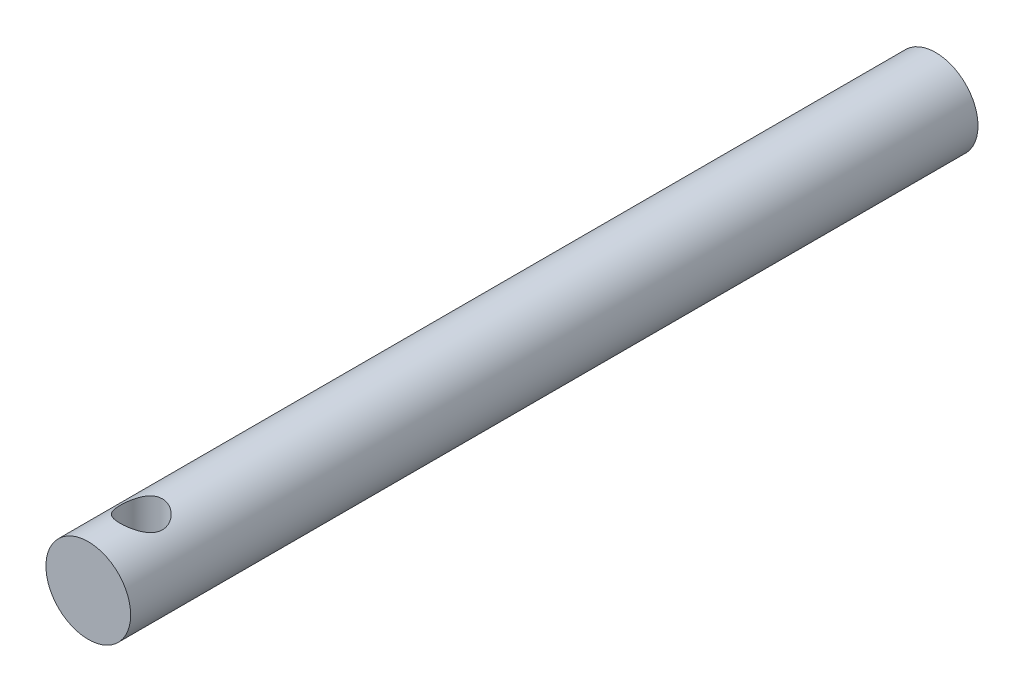
ISO-10303-21;
HEADER;
FILE_DESCRIPTION(('STEP AP214'),'2;1');
FILE_NAME('part.step','',(''),(''),'','','');
FILE_SCHEMA(('AUTOMOTIVE_DESIGN { 1 0 10303 214 1 1 1 1 }'));
ENDSEC;
DATA;
#1=APPLICATION_CONTEXT('core data for automotive mechanical design processes');
#2=APPLICATION_PROTOCOL_DEFINITION('international standard','automotive_design',2000,#1);
#3=PRODUCT_CONTEXT('',#1,'mechanical');
#4=PRODUCT('Part','Part','',(#3));
#5=PRODUCT_RELATED_PRODUCT_CATEGORY('part','',(#4));
#6=PRODUCT_DEFINITION_FORMATION('','',#4);
#7=PRODUCT_DEFINITION_CONTEXT('part definition',#1,'design');
#8=PRODUCT_DEFINITION('design','',#6,#7);
#9=PRODUCT_DEFINITION_SHAPE('','',#8);
#10=(LENGTH_UNIT() NAMED_UNIT(*) SI_UNIT(.MILLI.,.METRE.));
#11=(NAMED_UNIT(*) PLANE_ANGLE_UNIT() SI_UNIT($,.RADIAN.));
#12=(NAMED_UNIT(*) SI_UNIT($,.STERADIAN.) SOLID_ANGLE_UNIT());
#13=UNCERTAINTY_MEASURE_WITH_UNIT(LENGTH_MEASURE(1.E-05),#10,'distance_accuracy_value','');
#14=(GEOMETRIC_REPRESENTATION_CONTEXT(3) GLOBAL_UNCERTAINTY_ASSIGNED_CONTEXT((#13)) GLOBAL_UNIT_ASSIGNED_CONTEXT((#10,
#11,#12)) REPRESENTATION_CONTEXT('',''));
#15=CARTESIAN_POINT('',(0.,0.,0.));
#16=DIRECTION('',(0.,0.,1.));
#17=DIRECTION('',(1.,0.,0.));
#18=AXIS2_PLACEMENT_3D('',#15,#16,#17);
#19=CARTESIAN_POINT('',(0.,0.,160.));
#20=DIRECTION('',(0.,0.,-1.));
#21=DIRECTION('',(-1.,0.,0.));
#22=AXIS2_PLACEMENT_3D('',#19,#20,#21);
#23=CYLINDRICAL_SURFACE('',#22,8.);
#24=CARTESIAN_POINT('',(0.,-8.,146.));
#25=CARTESIAN_POINT('',(0.105191216468488,-7.99999964432188,146.000000404848));
#26=CARTESIAN_POINT('',(0.210389995368427,-7.99792027620652,146.004154457315));
#27=CARTESIAN_POINT('',(0.420011249701337,-7.98965597150982,146.020722078099));
#28=CARTESIAN_POINT('',(0.524433367425621,-7.98346924887743,146.03313923957));
#29=CARTESIAN_POINT('',(0.731828138370608,-7.96713597659603,146.066113514695));
#30=CARTESIAN_POINT('',(0.834798506711921,-7.95698378017499,146.086682236657));
#31=CARTESIAN_POINT('',(1.0384152051955,-7.93298382243633,146.135717207556));
#32=CARTESIAN_POINT('',(1.13906056699381,-7.91913455043164,146.164186685064));
#33=CARTESIAN_POINT('',(1.43561775388138,-7.87265974292142,146.260748231118));
#34=CARTESIAN_POINT('',(1.62719620658471,-7.83501976471674,146.340162980847));
#35=CARTESIAN_POINT('',(1.99392146995423,-7.74982886318844,146.526289041088));
#36=CARTESIAN_POINT('',(2.16906957469775,-7.70227872135526,146.632998199381));
#37=CARTESIAN_POINT('',(2.51002321260363,-7.59825056785885,146.878069822599));
#38=CARTESIAN_POINT('',(2.67462250306453,-7.54140647262265,147.017956688194));
#39=CARTESIAN_POINT('',(2.97911611963432,-7.42640030348014,147.322075137586));
#40=CARTESIAN_POINT('',(3.11899161990725,-7.36823726296469,147.486325099043));
#41=CARTESIAN_POINT('',(3.38102385527716,-7.25195135134797,147.84997898713));
#42=CARTESIAN_POINT('',(3.50096528772936,-7.19418138823907,148.051121304275));
#43=CARTESIAN_POINT('',(3.65378721735264,-7.11709930290977,148.367934539954));
#44=CARTESIAN_POINT('',(3.70022392693972,-7.09299422837207,148.476094662807));
#45=CARTESIAN_POINT('',(3.78359067078058,-7.04887690211805,148.696800971079));
#46=CARTESIAN_POINT('',(3.82052633371566,-7.02886222858683,148.809344513922));
#47=CARTESIAN_POINT('',(3.88251046204455,-6.9948044998643,149.031194219306));
#48=CARTESIAN_POINT('',(3.9081340887804,-6.9804776446802,149.140296419165));
#49=CARTESIAN_POINT('',(3.95018060072942,-6.95677065788592,149.36074052282));
#50=CARTESIAN_POINT('',(3.96660836750271,-6.9473879018896,149.472081205753));
#51=CARTESIAN_POINT('',(3.99001913809429,-6.93396933490057,149.696006093466));
#52=CARTESIAN_POINT('',(3.99700782997253,-6.92993030376772,149.808589508088));
#53=CARTESIAN_POINT('',(4.00144340059851,-6.92737022415464,150.034000478039));
#54=CARTESIAN_POINT('',(3.99889118971828,-6.92884864921081,150.146828009047));
#55=CARTESIAN_POINT('',(3.98516575152016,-6.93675038555111,150.358164378446));
#56=CARTESIAN_POINT('',(3.97506329407581,-6.94255931040712,150.456767439572));
#57=CARTESIAN_POINT('',(3.94763759493625,-6.95818925294571,150.652651612166));
#58=CARTESIAN_POINT('',(3.9303120853467,-6.96801153072176,150.74993229852));
#59=CARTESIAN_POINT('',(3.86777248849785,-7.00304835203764,151.0387791329));
#60=CARTESIAN_POINT('',(3.8119855502641,-7.03383903740602,151.227495457081));
#61=CARTESIAN_POINT('',(3.6728359957252,-7.10749917506982,151.596946332771));
#62=CARTESIAN_POINT('',(3.58886132884633,-7.15063327143764,151.777392575348));
#63=CARTESIAN_POINT('',(3.39616568981264,-7.2441365265382,152.122530187015));
#64=CARTESIAN_POINT('',(3.28743360222608,-7.29450893132236,152.287214432065));
#65=CARTESIAN_POINT('',(3.03227252755196,-7.40452458073482,152.618082881705));
#66=CARTESIAN_POINT('',(2.88281182497071,-7.46453347888883,152.781809570708));
#67=CARTESIAN_POINT('',(2.55818830727484,-7.58191186589975,153.0829596065));
#68=CARTESIAN_POINT('',(2.38301327894515,-7.63928008344307,153.220370382475));
#69=CARTESIAN_POINT('',(2.09944472683199,-7.72027607686169,153.406753030214));
#70=CARTESIAN_POINT('',(1.9989679987013,-7.74696304862188,153.466681759753));
#71=CARTESIAN_POINT('',(1.79256850112002,-7.79730441532266,153.577766478777));
#72=CARTESIAN_POINT('',(1.68664805204876,-7.82096008757468,153.628926166398));
#73=CARTESIAN_POINT('',(1.47010242051538,-7.86454042959534,153.721919122373));
#74=CARTESIAN_POINT('',(1.35947915341347,-7.88446660078232,153.763756145133));
#75=CARTESIAN_POINT('',(1.13432950721216,-7.91999221203723,153.837619938552));
#76=CARTESIAN_POINT('',(1.01980357880327,-7.9355921498224,153.869647837759));
#77=CARTESIAN_POINT('',(0.797438403015323,-7.96087677585623,153.921226847855));
#78=CARTESIAN_POINT('',(0.689830906854559,-7.9709443603734,153.941591597057));
#79=CARTESIAN_POINT('',(0.472998720376374,-7.98674429615844,153.973446448242));
#80=CARTESIAN_POINT('',(0.363774173887717,-7.99247703065614,153.984937334737));
#81=CARTESIAN_POINT('',(0.144648447401167,-7.99944300548302,153.998890471544));
#82=CARTESIAN_POINT('',(0.0347475425961409,-8.00067796839692,154.001356178379));
#83=CARTESIAN_POINT('',(-0.184837638972489,-7.99861804620746,153.99723575789));
#84=CARTESIAN_POINT('',(-0.294521925108022,-7.99532336157662,153.990650031163));
#85=CARTESIAN_POINT('',(-0.504259611746538,-7.98472734940324,153.969376430473));
#86=CARTESIAN_POINT('',(-0.604398259266984,-7.97775776257091,153.955358930896));
#87=CARTESIAN_POINT('',(-0.803035609307671,-7.96021983565122,153.919863600336));
#88=CARTESIAN_POINT('',(-0.901533743070591,-7.94965027363514,153.898383236207));
#89=CARTESIAN_POINT('',(-1.19351737727533,-7.91289127905722,153.8230648264));
#90=CARTESIAN_POINT('',(-1.38368108667205,-7.88164133135127,153.758329859409));
#91=CARTESIAN_POINT('',(-1.75558493783057,-7.80736894774679,153.600001891094));
#92=CARTESIAN_POINT('',(-1.93692876519228,-7.76403545540106,153.505636690828));
#93=CARTESIAN_POINT('',(-2.28183826656571,-7.66975878800211,153.29156896574));
#94=CARTESIAN_POINT('',(-2.44539632212196,-7.61881237399843,153.171855647368));
#95=CARTESIAN_POINT('',(-2.76706877708067,-7.50833088367007,152.896966880297));
#96=CARTESIAN_POINT('',(-2.92307134240143,-7.44844369061623,152.739463462741));
#97=CARTESIAN_POINT('',(-3.20744226426285,-7.33048735856256,152.400264434745));
#98=CARTESIAN_POINT('',(-3.33579150415336,-7.27241950081065,152.218552228397));
#99=CARTESIAN_POINT('',(-3.50772930633182,-7.19028164087442,151.926005985578));
#100=CARTESIAN_POINT('',(-3.56261578679478,-7.16316684054652,151.822516241564));
#101=CARTESIAN_POINT('',(-3.6633461615428,-7.11217812644118,151.610481564684));
#102=CARTESIAN_POINT('',(-3.70919441458264,-7.08830265221425,151.501939099905));
#103=CARTESIAN_POINT('',(-3.79131200961918,-7.04472262103752,151.280578354636));
#104=CARTESIAN_POINT('',(-3.82758904080802,-7.02501471854545,151.167763590205));
#105=CARTESIAN_POINT('',(-3.89012004539429,-6.9905825381999,150.938647210928));
#106=CARTESIAN_POINT('',(-3.91637557070638,-6.9758574887497,150.822346138978));
#107=CARTESIAN_POINT('',(-3.95643062416587,-6.9532102561999,150.598587866837));
#108=CARTESIAN_POINT('',(-3.97118378192521,-6.94477079792059,150.491353167092));
#109=CARTESIAN_POINT('',(-3.99195118317072,-6.93285441469714,150.275772329799));
#110=CARTESIAN_POINT('',(-3.99796634225491,-6.92937696981658,150.167426309899));
#111=CARTESIAN_POINT('',(-4.00116308319383,-6.92753208063798,149.95059250327));
#112=CARTESIAN_POINT('',(-3.99834777004019,-6.92916284018069,149.842104779777));
#113=CARTESIAN_POINT('',(-3.98394653809982,-6.9374509348198,149.625938852886));
#114=CARTESIAN_POINT('',(-3.97236097836303,-6.94410806413885,149.518260616531));
#115=CARTESIAN_POINT('',(-3.92770249100378,-6.9695287958286,149.218199862959));
#116=CARTESIAN_POINT('',(-3.88483285002043,-6.99372760142387,149.027634132686));
#117=CARTESIAN_POINT('',(-3.77270184038046,-7.05483682415845,148.656731497447));
#118=CARTESIAN_POINT('',(-3.70343198216887,-7.09175132993569,148.476397904296));
#119=CARTESIAN_POINT('',(-3.53526338936953,-7.17714225279384,148.117511446486));
#120=CARTESIAN_POINT('',(-3.43468670285355,-7.22622883383996,147.939892224238));
#121=CARTESIAN_POINT('',(-3.20860173383709,-7.32941332742359,147.602898021723));
#122=CARTESIAN_POINT('',(-3.08308048046464,-7.38351383930109,147.443532601459));
#123=CARTESIAN_POINT('',(-2.79282250805388,-7.49849148240842,147.127437090961));
#124=CARTESIAN_POINT('',(-2.62517402605098,-7.55939328373464,146.973380070376));
#125=CARTESIAN_POINT('',(-2.26458287075638,-7.67511613929542,146.694931577187));
#126=CARTESIAN_POINT('',(-2.0716266499056,-7.72993390744395,146.570556094758));
#127=CARTESIAN_POINT('',(-1.76603106757847,-7.80335210517359,146.409095750585));
#128=CARTESIAN_POINT('',(-1.66100410373828,-7.82643367929071,146.359306358591));
#129=CARTESIAN_POINT('',(-1.44639623629744,-7.8689179624278,146.268851052999));
#130=CARTESIAN_POINT('',(-1.33681760142932,-7.88832247803741,146.228180657302));
#131=CARTESIAN_POINT('',(-1.11415600876093,-7.92283587265691,146.156523655566));
#132=CARTESIAN_POINT('',(-1.00108129646084,-7.93795411409434,146.125515928613));
#133=CARTESIAN_POINT('',(-0.772189766950839,-7.96347694583625,146.073489919984));
#134=CARTESIAN_POINT('',(-0.65637467030461,-7.97388441530453,146.052465536228));
#135=CARTESIAN_POINT('',(-0.450433316283297,-7.98781110043795,146.024420378801));
#136=CARTESIAN_POINT('',(-0.360660623567805,-7.99237392421377,146.015270610824));
#137=CARTESIAN_POINT('',(-0.180593821057083,-7.99846856848792,146.003060163622));
#138=CARTESIAN_POINT('',(-0.0902996969389638,-8.00000030532612,145.999999652465));
#139=CARTESIAN_POINT('',(0.,-8.,146.));
#140=B_SPLINE_CURVE_WITH_KNOTS('',3,(#24,#25,#26,#27,#28,#29,#30,#31,#32,#33,#34,#35,#36,#37,
#38,#39,#40,#41,#42,#43,#44,#45,#46,#47,#48,#49,#50,#51,#52,#53,#54,#55,#56,#57,#58,#59,#60,#61,
#62,#63,#64,#65,#66,#67,#68,#69,#70,#71,#72,#73,#74,#75,#76,#77,#78,#79,#80,#81,#82,#83,#84,#85,
#86,#87,#88,#89,#90,#91,#92,#93,#94,#95,#96,#97,#98,#99,#100,#101,#102,#103,#104,#105,#106,#107,
#108,#109,#110,#111,#112,#113,#114,#115,#116,#117,#118,#119,#120,#121,#122,#123,#124,#125,#126,
#127,#128,#129,#130,#131,#132,#133,#134,#135,#136,#137,#138,#139),.UNSPECIFIED.,.T.,.F.,(4,2,2,
2,2,2,2,2,2,2,2,2,2,2,2,2,2,2,2,2,2,2,2,2,2,2,2,2,2,2,2,2,2,2,2,2,2,2,2,2,2,2,2,2,2,2,2,2,2,2,2,
2,2,2,2,2,2,4),(0.,0.315484235719913,0.631105747230255,0.947178346952281,1.26338029745355,
1.89263632058596,2.52184274094304,3.18911473348914,3.8568926492329,4.57645675584685,
4.93648208726458,5.29629363598335,5.63476191634053,5.97305035229577,6.31113484191768,
6.64918707308225,6.9466914865286,7.24428938086225,7.83905304157542,8.44767049128776,
9.05656173495714,9.74265853790342,10.4290822684957,10.7886699173095,11.1481055433964,
11.5073961555811,11.8666454155399,12.1961419049363,12.5256092612256,12.8549504227676,
13.184277008843,13.4879760335491,13.791778244799,14.3988188497914,15.0232162256701,
15.6478800144877,16.33388641032,17.0203655291613,17.3806820308649,17.7408243397693,
18.1006764355618,18.4604727825931,18.7857371805984,19.1109674938046,19.4360834615764,
19.7611861199665,20.3488209353336,20.9366448769134,21.5639619965908,22.1916061711246,
22.8955134356509,23.5997990605888,23.9548906509477,24.309807324981,24.6639426811876,
25.0178613011449,25.2886761616556,25.5594984967416),.UNSPECIFIED.);
#141=CARTESIAN_POINT('',(0.,-8.,146.));
#142=VERTEX_POINT('',#141);
#143=EDGE_CURVE('E55',#142,#142,#140,.T.);
#144=ORIENTED_EDGE('',*,*,#143,.F.);
#145=EDGE_LOOP('',(#144));
#146=FACE_BOUND('',#145,.T.);
#147=CARTESIAN_POINT('',(0.,0.,160.));
#148=DIRECTION('',(0.,0.,1.));
#149=DIRECTION('',(1.,0.,0.));
#150=AXIS2_PLACEMENT_3D('',#147,#148,#149);
#151=CIRCLE('',#150,8.);
#152=CARTESIAN_POINT('',(8.,0.,160.));
#153=VERTEX_POINT('',#152);
#154=EDGE_CURVE('E10',#153,#153,#151,.T.);
#155=ORIENTED_EDGE('',*,*,#154,.F.);
#156=EDGE_LOOP('',(#155));
#157=FACE_BOUND('',#156,.T.);
#158=CARTESIAN_POINT('',(0.,0.,0.));
#159=DIRECTION('',(0.,0.,1.));
#160=DIRECTION('',(1.,0.,0.));
#161=AXIS2_PLACEMENT_3D('',#158,#159,#160);
#162=CIRCLE('',#161,8.);
#163=CARTESIAN_POINT('',(8.,0.,0.));
#164=VERTEX_POINT('',#163);
#165=EDGE_CURVE('E46',#164,#164,#162,.T.);
#166=ORIENTED_EDGE('',*,*,#165,.T.);
#167=EDGE_LOOP('',(#166));
#168=FACE_BOUND('',#167,.T.);
#169=CARTESIAN_POINT('',(0.,8.,146.));
#170=CARTESIAN_POINT('',(-0.105191216468488,7.99999964432188,146.000000404848));
#171=CARTESIAN_POINT('',(-0.210389995368427,7.99792027620652,146.004154457315));
#172=CARTESIAN_POINT('',(-0.420011249701337,7.98965597150982,146.020722078099));
#173=CARTESIAN_POINT('',(-0.524433367425621,7.98346924887743,146.03313923957));
#174=CARTESIAN_POINT('',(-0.731828138370608,7.96713597659603,146.066113514695));
#175=CARTESIAN_POINT('',(-0.834798506711921,7.95698378017499,146.086682236657));
#176=CARTESIAN_POINT('',(-1.0384152051955,7.93298382243633,146.135717207556));
#177=CARTESIAN_POINT('',(-1.13906056699381,7.91913455043164,146.164186685064));
#178=CARTESIAN_POINT('',(-1.43561775388138,7.87265974292142,146.260748231118));
#179=CARTESIAN_POINT('',(-1.62719620658471,7.83501976471674,146.340162980847));
#180=CARTESIAN_POINT('',(-1.99392146995423,7.74982886318844,146.526289041088));
#181=CARTESIAN_POINT('',(-2.16906957469775,7.70227872135526,146.632998199381));
#182=CARTESIAN_POINT('',(-2.51002321260363,7.59825056785885,146.878069822599));
#183=CARTESIAN_POINT('',(-2.67462250306453,7.54140647262265,147.017956688194));
#184=CARTESIAN_POINT('',(-2.97911611963432,7.42640030348014,147.322075137586));
#185=CARTESIAN_POINT('',(-3.11899161990725,7.36823726296469,147.486325099043));
#186=CARTESIAN_POINT('',(-3.38102385527716,7.25195135134797,147.84997898713));
#187=CARTESIAN_POINT('',(-3.50096528772936,7.19418138823907,148.051121304275));
#188=CARTESIAN_POINT('',(-3.65378721735264,7.11709930290977,148.367934539954));
#189=CARTESIAN_POINT('',(-3.70022392693972,7.09299422837207,148.476094662807));
#190=CARTESIAN_POINT('',(-3.78359067078058,7.04887690211805,148.696800971079));
#191=CARTESIAN_POINT('',(-3.82052633371566,7.02886222858683,148.809344513922));
#192=CARTESIAN_POINT('',(-3.88251046204455,6.9948044998643,149.031194219306));
#193=CARTESIAN_POINT('',(-3.9081340887804,6.9804776446802,149.140296419165));
#194=CARTESIAN_POINT('',(-3.95018060072942,6.95677065788592,149.36074052282));
#195=CARTESIAN_POINT('',(-3.96660836750271,6.9473879018896,149.472081205753));
#196=CARTESIAN_POINT('',(-3.99001913809429,6.93396933490057,149.696006093466));
#197=CARTESIAN_POINT('',(-3.99700782997253,6.92993030376772,149.808589508088));
#198=CARTESIAN_POINT('',(-4.00144340059851,6.92737022415464,150.034000478039));
#199=CARTESIAN_POINT('',(-3.99889118971828,6.92884864921081,150.146828009047));
#200=CARTESIAN_POINT('',(-3.98516575152016,6.93675038555111,150.358164378446));
#201=CARTESIAN_POINT('',(-3.97506329407581,6.94255931040712,150.456767439572));
#202=CARTESIAN_POINT('',(-3.94763759493625,6.95818925294571,150.652651612166));
#203=CARTESIAN_POINT('',(-3.9303120853467,6.96801153072176,150.74993229852));
#204=CARTESIAN_POINT('',(-3.86777248849785,7.00304835203764,151.0387791329));
#205=CARTESIAN_POINT('',(-3.8119855502641,7.03383903740602,151.227495457081));
#206=CARTESIAN_POINT('',(-3.6728359957252,7.10749917506982,151.596946332771));
#207=CARTESIAN_POINT('',(-3.58886132884633,7.15063327143764,151.777392575348));
#208=CARTESIAN_POINT('',(-3.39616568981264,7.2441365265382,152.122530187015));
#209=CARTESIAN_POINT('',(-3.28743360222608,7.29450893132236,152.287214432065));
#210=CARTESIAN_POINT('',(-3.03227252755196,7.40452458073482,152.618082881705));
#211=CARTESIAN_POINT('',(-2.88281182497071,7.46453347888883,152.781809570708));
#212=CARTESIAN_POINT('',(-2.55818830727484,7.58191186589975,153.0829596065));
#213=CARTESIAN_POINT('',(-2.38301327894515,7.63928008344307,153.220370382475));
#214=CARTESIAN_POINT('',(-2.09944472683199,7.72027607686169,153.406753030214));
#215=CARTESIAN_POINT('',(-1.9989679987013,7.74696304862188,153.466681759753));
#216=CARTESIAN_POINT('',(-1.79256850112002,7.79730441532266,153.577766478777));
#217=CARTESIAN_POINT('',(-1.68664805204876,7.82096008757468,153.628926166398));
#218=CARTESIAN_POINT('',(-1.47010242051538,7.86454042959534,153.721919122373));
#219=CARTESIAN_POINT('',(-1.35947915341347,7.88446660078232,153.763756145133));
#220=CARTESIAN_POINT('',(-1.13432950721216,7.91999221203723,153.837619938552));
#221=CARTESIAN_POINT('',(-1.01980357880327,7.9355921498224,153.869647837759));
#222=CARTESIAN_POINT('',(-0.797438403015323,7.96087677585623,153.921226847855));
#223=CARTESIAN_POINT('',(-0.689830906854559,7.9709443603734,153.941591597057));
#224=CARTESIAN_POINT('',(-0.472998720376374,7.98674429615844,153.973446448242));
#225=CARTESIAN_POINT('',(-0.363774173887717,7.99247703065614,153.984937334737));
#226=CARTESIAN_POINT('',(-0.144648447401167,7.99944300548302,153.998890471544));
#227=CARTESIAN_POINT('',(-0.0347475425961409,8.00067796839692,154.001356178379));
#228=CARTESIAN_POINT('',(0.184837638972489,7.99861804620746,153.99723575789));
#229=CARTESIAN_POINT('',(0.294521925108022,7.99532336157662,153.990650031163));
#230=CARTESIAN_POINT('',(0.504259611746538,7.98472734940324,153.969376430473));
#231=CARTESIAN_POINT('',(0.604398259266984,7.97775776257091,153.955358930896));
#232=CARTESIAN_POINT('',(0.803035609307671,7.96021983565122,153.919863600336));
#233=CARTESIAN_POINT('',(0.901533743070591,7.94965027363514,153.898383236207));
#234=CARTESIAN_POINT('',(1.19351737727533,7.91289127905722,153.8230648264));
#235=CARTESIAN_POINT('',(1.38368108667205,7.88164133135127,153.758329859409));
#236=CARTESIAN_POINT('',(1.75558493783057,7.80736894774679,153.600001891094));
#237=CARTESIAN_POINT('',(1.93692876519228,7.76403545540106,153.505636690828));
#238=CARTESIAN_POINT('',(2.28183826656571,7.66975878800211,153.29156896574));
#239=CARTESIAN_POINT('',(2.44539632212196,7.61881237399843,153.171855647368));
#240=CARTESIAN_POINT('',(2.76706877708067,7.50833088367007,152.896966880297));
#241=CARTESIAN_POINT('',(2.92307134240143,7.44844369061623,152.739463462741));
#242=CARTESIAN_POINT('',(3.20744226426285,7.33048735856256,152.400264434745));
#243=CARTESIAN_POINT('',(3.33579150415336,7.27241950081065,152.218552228397));
#244=CARTESIAN_POINT('',(3.50772930633182,7.19028164087442,151.926005985578));
#245=CARTESIAN_POINT('',(3.56261578679478,7.16316684054652,151.822516241564));
#246=CARTESIAN_POINT('',(3.6633461615428,7.11217812644118,151.610481564684));
#247=CARTESIAN_POINT('',(3.70919441458264,7.08830265221425,151.501939099905));
#248=CARTESIAN_POINT('',(3.79131200961918,7.04472262103752,151.280578354636));
#249=CARTESIAN_POINT('',(3.82758904080802,7.02501471854545,151.167763590205));
#250=CARTESIAN_POINT('',(3.89012004539429,6.9905825381999,150.938647210928));
#251=CARTESIAN_POINT('',(3.91637557070638,6.9758574887497,150.822346138978));
#252=CARTESIAN_POINT('',(3.95643062416587,6.9532102561999,150.598587866837));
#253=CARTESIAN_POINT('',(3.97118378192521,6.94477079792059,150.491353167092));
#254=CARTESIAN_POINT('',(3.99195118317072,6.93285441469714,150.275772329799));
#255=CARTESIAN_POINT('',(3.99796634225491,6.92937696981658,150.167426309899));
#256=CARTESIAN_POINT('',(4.00116308319383,6.92753208063798,149.95059250327));
#257=CARTESIAN_POINT('',(3.99834777004019,6.92916284018069,149.842104779777));
#258=CARTESIAN_POINT('',(3.98394653809982,6.9374509348198,149.625938852886));
#259=CARTESIAN_POINT('',(3.97236097836303,6.94410806413885,149.518260616531));
#260=CARTESIAN_POINT('',(3.92770249100378,6.9695287958286,149.218199862959));
#261=CARTESIAN_POINT('',(3.88483285002043,6.99372760142387,149.027634132686));
#262=CARTESIAN_POINT('',(3.77270184038046,7.05483682415845,148.656731497447));
#263=CARTESIAN_POINT('',(3.70343198216887,7.09175132993569,148.476397904296));
#264=CARTESIAN_POINT('',(3.53526338936953,7.17714225279384,148.117511446486));
#265=CARTESIAN_POINT('',(3.43468670285355,7.22622883383996,147.939892224238));
#266=CARTESIAN_POINT('',(3.20860173383709,7.32941332742359,147.602898021723));
#267=CARTESIAN_POINT('',(3.08308048046464,7.38351383930109,147.443532601459));
#268=CARTESIAN_POINT('',(2.79282250805388,7.49849148240842,147.127437090961));
#269=CARTESIAN_POINT('',(2.62517402605098,7.55939328373464,146.973380070376));
#270=CARTESIAN_POINT('',(2.26458287075638,7.67511613929542,146.694931577187));
#271=CARTESIAN_POINT('',(2.0716266499056,7.72993390744395,146.570556094758));
#272=CARTESIAN_POINT('',(1.76603106757847,7.80335210517359,146.409095750585));
#273=CARTESIAN_POINT('',(1.66100410373828,7.82643367929071,146.359306358591));
#274=CARTESIAN_POINT('',(1.44639623629744,7.8689179624278,146.268851052999));
#275=CARTESIAN_POINT('',(1.33681760142932,7.88832247803741,146.228180657302));
#276=CARTESIAN_POINT('',(1.11415600876093,7.92283587265691,146.156523655566));
#277=CARTESIAN_POINT('',(1.00108129646084,7.93795411409434,146.125515928613));
#278=CARTESIAN_POINT('',(0.772189766950839,7.96347694583625,146.073489919984));
#279=CARTESIAN_POINT('',(0.65637467030461,7.97388441530453,146.052465536228));
#280=CARTESIAN_POINT('',(0.450433316283297,7.98781110043795,146.024420378801));
#281=CARTESIAN_POINT('',(0.360660623567805,7.99237392421377,146.015270610824));
#282=CARTESIAN_POINT('',(0.180593821057083,7.99846856848792,146.003060163622));
#283=CARTESIAN_POINT('',(0.0902996969389638,8.00000030532612,145.999999652465));
#284=CARTESIAN_POINT('',(0.,8.,146.));
#285=B_SPLINE_CURVE_WITH_KNOTS('',3,(#169,#170,#171,#172,#173,#174,#175,#176,#177,#178,#179,
#180,#181,#182,#183,#184,#185,#186,#187,#188,#189,#190,#191,#192,#193,#194,#195,#196,#197,#198,
#199,#200,#201,#202,#203,#204,#205,#206,#207,#208,#209,#210,#211,#212,#213,#214,#215,#216,#217,
#218,#219,#220,#221,#222,#223,#224,#225,#226,#227,#228,#229,#230,#231,#232,#233,#234,#235,#236,
#237,#238,#239,#240,#241,#242,#243,#244,#245,#246,#247,#248,#249,#250,#251,#252,#253,#254,#255,
#256,#257,#258,#259,#260,#261,#262,#263,#264,#265,#266,#267,#268,#269,#270,#271,#272,#273,#274,
#275,#276,#277,#278,#279,#280,#281,#282,#283,#284),.UNSPECIFIED.,.T.,.F.,(4,2,2,2,2,2,2,2,2,2,2,
2,2,2,2,2,2,2,2,2,2,2,2,2,2,2,2,2,2,2,2,2,2,2,2,2,2,2,2,2,2,2,2,2,2,2,2,2,2,2,2,2,2,2,2,2,2,4),
(0.,0.315484235719913,0.631105747230255,0.947178346952281,1.26338029745355,1.89263632058596,
2.52184274094304,3.18911473348914,3.8568926492329,4.57645675584685,4.93648208726458,
5.29629363598335,5.63476191634053,5.97305035229577,6.31113484191768,6.64918707308225,
6.9466914865286,7.24428938086225,7.83905304157542,8.44767049128776,9.05656173495714,
9.74265853790342,10.4290822684957,10.7886699173095,11.1481055433964,11.5073961555811,
11.8666454155399,12.1961419049363,12.5256092612256,12.8549504227676,13.184277008843,
13.4879760335491,13.791778244799,14.3988188497914,15.0232162256701,15.6478800144877,
16.33388641032,17.0203655291613,17.3806820308649,17.7408243397693,18.1006764355618,
18.4604727825931,18.7857371805984,19.1109674938046,19.4360834615764,19.7611861199665,
20.3488209353336,20.9366448769134,21.5639619965908,22.1916061711246,22.8955134356509,
23.5997990605888,23.9548906509477,24.309807324981,24.6639426811876,25.0178613011449,
25.2886761616556,25.5594984967416),.UNSPECIFIED.);
#286=CARTESIAN_POINT('',(0.,8.,146.));
#287=VERTEX_POINT('',#286);
#288=EDGE_CURVE('E39',#287,#287,#285,.T.);
#289=ORIENTED_EDGE('',*,*,#288,.F.);
#290=EDGE_LOOP('',(#289));
#291=FACE_BOUND('',#290,.T.);
#292=ADVANCED_FACE('F35',(#146,#157,#168,#291),#23,.T.);
#293=CARTESIAN_POINT('',(0.,0.,160.));
#294=DIRECTION('',(0.,0.,1.));
#295=DIRECTION('',(1.,0.,0.));
#296=AXIS2_PLACEMENT_3D('',#293,#294,#295);
#297=PLANE('',#296);
#298=ORIENTED_EDGE('',*,*,#154,.T.);
#299=EDGE_LOOP('',(#298));
#300=FACE_BOUND('',#299,.T.);
#301=ADVANCED_FACE('F69',(#300),#297,.T.);
#302=CARTESIAN_POINT('',(0.,0.,0.));
#303=DIRECTION('',(0.,0.,1.));
#304=DIRECTION('',(1.,0.,0.));
#305=AXIS2_PLACEMENT_3D('',#302,#303,#304);
#306=PLANE('',#305);
#307=CARTESIAN_POINT('',(0.,0.,0.));
#308=DIRECTION('',(0.,0.,-1.));
#309=DIRECTION('',(-1.,0.,0.));
#310=AXIS2_PLACEMENT_3D('',#307,#308,#309);
#311=CIRCLE('',#310,4.);
#312=CARTESIAN_POINT('',(-4.,0.,0.));
#313=VERTEX_POINT('',#312);
#314=EDGE_CURVE('E53',#313,#313,#311,.T.);
#315=ORIENTED_EDGE('',*,*,#314,.F.);
#316=EDGE_LOOP('',(#315));
#317=FACE_BOUND('',#316,.T.);
#318=ORIENTED_EDGE('',*,*,#165,.F.);
#319=EDGE_LOOP('',(#318));
#320=FACE_BOUND('',#319,.T.);
#321=ADVANCED_FACE('F66',(#317,#320),#306,.F.);
#322=CARTESIAN_POINT('',(0.,120.,150.));
#323=DIRECTION('',(0.,-1.,0.));
#324=DIRECTION('',(0.,0.,-1.));
#325=AXIS2_PLACEMENT_3D('',#322,#323,#324);
#326=CYLINDRICAL_SURFACE('',#325,4.00000000000001);
#327=ORIENTED_EDGE('',*,*,#143,.T.);
#328=EDGE_LOOP('',(#327));
#329=FACE_BOUND('',#328,.T.);
#330=ORIENTED_EDGE('',*,*,#288,.T.);
#331=EDGE_LOOP('',(#330));
#332=FACE_BOUND('',#331,.T.);
#333=ADVANCED_FACE('F60',(#329,#332),#326,.F.);
#334=CARTESIAN_POINT('',(0.,0.,10.));
#335=DIRECTION('',(0.,0.,-1.));
#336=DIRECTION('',(-1.,0.,0.));
#337=AXIS2_PLACEMENT_3D('',#334,#335,#336);
#338=CYLINDRICAL_SURFACE('',#337,4.);
#339=CARTESIAN_POINT('',(0.,0.,10.));
#340=DIRECTION('',(0.,0.,-1.));
#341=DIRECTION('',(-1.,0.,0.));
#342=AXIS2_PLACEMENT_3D('',#339,#340,#341);
#343=CIRCLE('',#342,4.);
#344=CARTESIAN_POINT('',(-4.,0.,10.));
#345=VERTEX_POINT('',#344);
#346=EDGE_CURVE('E59',#345,#345,#343,.T.);
#347=ORIENTED_EDGE('',*,*,#346,.F.);
#348=EDGE_LOOP('',(#347));
#349=FACE_BOUND('',#348,.T.);
#350=ORIENTED_EDGE('',*,*,#314,.T.);
#351=EDGE_LOOP('',(#350));
#352=FACE_BOUND('',#351,.T.);
#353=ADVANCED_FACE('F65',(#349,#352),#338,.F.);
#354=CARTESIAN_POINT('',(0.,0.,10.));
#355=DIRECTION('',(0.,0.,-1.));
#356=DIRECTION('',(-1.,0.,0.));
#357=AXIS2_PLACEMENT_3D('',#354,#355,#356);
#358=PLANE('',#357);
#359=ORIENTED_EDGE('',*,*,#346,.T.);
#360=EDGE_LOOP('',(#359));
#361=FACE_BOUND('',#360,.T.);
#362=ADVANCED_FACE('F116',(#361),#358,.T.);
#363=CLOSED_SHELL('',(#292,#301,#321,#333,#353,#362));
#364=MANIFOLD_SOLID_BREP('B2',#363);
#365=ADVANCED_BREP_SHAPE_REPRESENTATION('',(#18,#364),#14);
#366=SHAPE_DEFINITION_REPRESENTATION(#9,#365);
ENDSEC;
END-ISO-10303-21;
